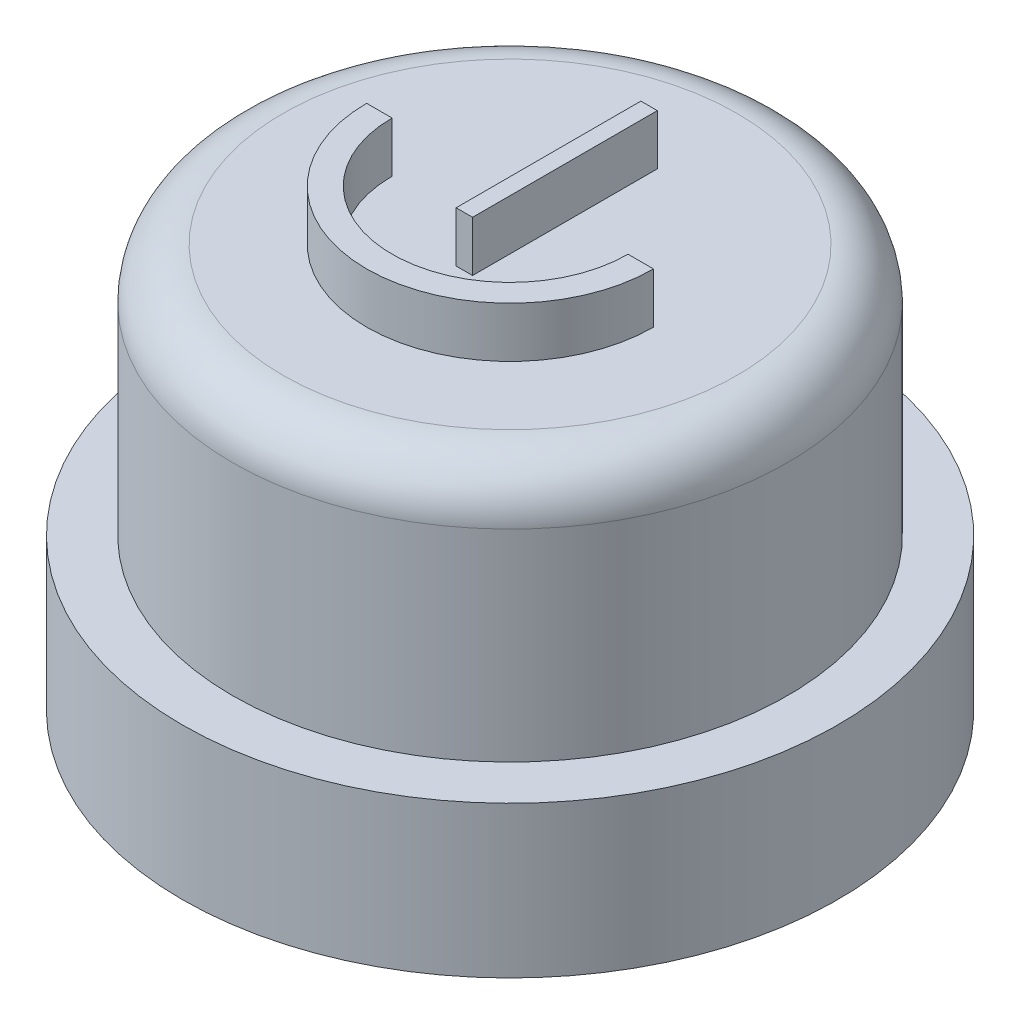
ISO-10303-21;
HEADER;
FILE_DESCRIPTION(('STEP AP214'),'2;1');
FILE_NAME('part.step','',(''),(''),'','','');
FILE_SCHEMA(('AUTOMOTIVE_DESIGN { 1 0 10303 214 1 1 1 1 }'));
ENDSEC;
DATA;
#1=APPLICATION_CONTEXT('core data for automotive mechanical design processes');
#2=APPLICATION_PROTOCOL_DEFINITION('international standard','automotive_design',2000,#1);
#3=PRODUCT_CONTEXT('',#1,'mechanical');
#4=PRODUCT('Part','Part','',(#3));
#5=PRODUCT_RELATED_PRODUCT_CATEGORY('part','',(#4));
#6=PRODUCT_DEFINITION_FORMATION('','',#4);
#7=PRODUCT_DEFINITION_CONTEXT('part definition',#1,'design');
#8=PRODUCT_DEFINITION('design','',#6,#7);
#9=PRODUCT_DEFINITION_SHAPE('','',#8);
#10=(LENGTH_UNIT() NAMED_UNIT(*) SI_UNIT(.MILLI.,.METRE.));
#11=(NAMED_UNIT(*) PLANE_ANGLE_UNIT() SI_UNIT($,.RADIAN.));
#12=(NAMED_UNIT(*) SI_UNIT($,.STERADIAN.) SOLID_ANGLE_UNIT());
#13=UNCERTAINTY_MEASURE_WITH_UNIT(LENGTH_MEASURE(1.E-05),#10,'distance_accuracy_value','');
#14=(GEOMETRIC_REPRESENTATION_CONTEXT(3) GLOBAL_UNCERTAINTY_ASSIGNED_CONTEXT((#13)) GLOBAL_UNIT_ASSIGNED_CONTEXT((#10,
#11,#12)) REPRESENTATION_CONTEXT('',''));
#15=CARTESIAN_POINT('',(0.,0.,0.));
#16=DIRECTION('',(0.,0.,1.));
#17=DIRECTION('',(1.,0.,0.));
#18=AXIS2_PLACEMENT_3D('',#15,#16,#17);
#19=CARTESIAN_POINT('',(0.,8.,0.));
#20=DIRECTION('',(0.,1.,0.));
#21=DIRECTION('',(0.,0.,1.));
#22=AXIS2_PLACEMENT_3D('',#19,#20,#21);
#23=PLANE('',#22);
#24=CARTESIAN_POINT('',(0.,8.,0.));
#25=DIRECTION('',(0.,1.,0.));
#26=DIRECTION('',(0.,0.,1.));
#27=AXIS2_PLACEMENT_3D('',#24,#25,#26);
#28=CIRCLE('',#27,4.5);
#29=CARTESIAN_POINT('',(0.,8.,4.5));
#30=VERTEX_POINT('',#29);
#31=EDGE_CURVE('E52',#30,#30,#28,.T.);
#32=ORIENTED_EDGE('',*,*,#31,.T.);
#33=EDGE_LOOP('',(#32));
#34=FACE_BOUND('',#33,.T.);
#35=DIRECTION('',(-1.,0.,0.));
#36=VECTOR('',#35,1.);
#37=CARTESIAN_POINT('',(2.33911709935371,8.,0.));
#38=LINE('',#37,#36);
#39=CARTESIAN_POINT('',(2.84359749629718,8.,0.));
#40=VERTEX_POINT('',#39);
#41=CARTESIAN_POINT('',(2.33911709935371,8.,0.));
#42=VERTEX_POINT('',#41);
#43=EDGE_CURVE('E139',#40,#42,#38,.T.);
#44=ORIENTED_EDGE('',*,*,#43,.F.);
#45=CARTESIAN_POINT('',(0.,8.,0.));
#46=DIRECTION('',(0.,1.,0.));
#47=DIRECTION('',(0.,0.,1.));
#48=AXIS2_PLACEMENT_3D('',#45,#46,#47);
#49=CIRCLE('',#48,2.84359749629718);
#50=CARTESIAN_POINT('',(-2.84359749629718,8.,0.));
#51=VERTEX_POINT('',#50);
#52=EDGE_CURVE('E134',#51,#40,#49,.T.);
#53=ORIENTED_EDGE('',*,*,#52,.F.);
#54=DIRECTION('',(-1.,0.,0.));
#55=VECTOR('',#54,1.);
#56=CARTESIAN_POINT('',(-2.84359749629718,8.,0.));
#57=LINE('',#56,#55);
#58=CARTESIAN_POINT('',(-2.33911709935371,8.,0.));
#59=VERTEX_POINT('',#58);
#60=EDGE_CURVE('E159',#59,#51,#57,.T.);
#61=ORIENTED_EDGE('',*,*,#60,.F.);
#62=CARTESIAN_POINT('',(0.,8.,0.));
#63=DIRECTION('',(0.,-1.,0.));
#64=DIRECTION('',(0.,0.,1.));
#65=AXIS2_PLACEMENT_3D('',#62,#63,#64);
#66=CIRCLE('',#65,2.33911709935371);
#67=EDGE_CURVE('E171',#42,#59,#66,.T.);
#68=ORIENTED_EDGE('',*,*,#67,.F.);
#69=EDGE_LOOP('',(#44,#53,#61,#68));
#70=FACE_BOUND('',#69,.T.);
#71=DIRECTION('',(-1.,0.,0.));
#72=VECTOR('',#71,1.);
#73=CARTESIAN_POINT('',(-0.163194216233981,8.,-2.75616898528501));
#74=LINE('',#73,#72);
#75=CARTESIAN_POINT('',(0.163194216233981,8.,-2.75616898528501));
#76=VERTEX_POINT('',#75);
#77=CARTESIAN_POINT('',(-0.163194216233981,8.,-2.75616898528501));
#78=VERTEX_POINT('',#77);
#79=EDGE_CURVE('E132',#76,#78,#74,.T.);
#80=ORIENTED_EDGE('',*,*,#79,.F.);
#81=DIRECTION('',(0.,0.,-1.));
#82=VECTOR('',#81,1.);
#83=CARTESIAN_POINT('',(0.163194216233981,8.,-2.75616898528501));
#84=LINE('',#83,#82);
#85=CARTESIAN_POINT('',(0.163194216233981,8.,0.906634534633198));
#86=VERTEX_POINT('',#85);
#87=EDGE_CURVE('E126',#86,#76,#84,.T.);
#88=ORIENTED_EDGE('',*,*,#87,.F.);
#89=DIRECTION('',(1.,0.,0.));
#90=VECTOR('',#89,1.);
#91=CARTESIAN_POINT('',(-0.163194216233981,8.,0.906634534633198));
#92=LINE('',#91,#90);
#93=CARTESIAN_POINT('',(-0.163194216233981,8.,0.906634534633198));
#94=VERTEX_POINT('',#93);
#95=EDGE_CURVE('E110',#94,#86,#92,.T.);
#96=ORIENTED_EDGE('',*,*,#95,.F.);
#97=DIRECTION('',(0.,0.,1.));
#98=VECTOR('',#97,1.);
#99=CARTESIAN_POINT('',(-0.163194216233981,8.,-2.75616898528501));
#100=LINE('',#99,#98);
#101=EDGE_CURVE('E119',#78,#94,#100,.T.);
#102=ORIENTED_EDGE('',*,*,#101,.F.);
#103=EDGE_LOOP('',(#80,#88,#96,#102));
#104=FACE_BOUND('',#103,.T.);
#105=ADVANCED_FACE('F43',(#34,#70,#104),#23,.T.);
#106=CARTESIAN_POINT('',(0.,3.,0.));
#107=DIRECTION('',(0.,-1.,0.));
#108=DIRECTION('',(0.,0.,-1.));
#109=AXIS2_PLACEMENT_3D('',#106,#107,#108);
#110=CYLINDRICAL_SURFACE('',#109,6.5);
#111=CARTESIAN_POINT('',(0.,3.,0.));
#112=DIRECTION('',(0.,1.,0.));
#113=DIRECTION('',(0.,0.,1.));
#114=AXIS2_PLACEMENT_3D('',#111,#112,#113);
#115=CIRCLE('',#114,6.5);
#116=CARTESIAN_POINT('',(0.,3.,6.5));
#117=VERTEX_POINT('',#116);
#118=EDGE_CURVE('E193',#117,#117,#115,.T.);
#119=ORIENTED_EDGE('',*,*,#118,.F.);
#120=EDGE_LOOP('',(#119));
#121=FACE_BOUND('',#120,.T.);
#122=CARTESIAN_POINT('',(0.,0.,0.));
#123=DIRECTION('',(0.,1.,0.));
#124=DIRECTION('',(0.,0.,1.));
#125=AXIS2_PLACEMENT_3D('',#122,#123,#124);
#126=CIRCLE('',#125,6.5);
#127=CARTESIAN_POINT('',(0.,0.,6.5));
#128=VERTEX_POINT('',#127);
#129=EDGE_CURVE('E188',#128,#128,#126,.T.);
#130=ORIENTED_EDGE('',*,*,#129,.T.);
#131=EDGE_LOOP('',(#130));
#132=FACE_BOUND('',#131,.T.);
#133=ADVANCED_FACE('F221',(#121,#132),#110,.T.);
#134=CARTESIAN_POINT('',(0.,3.,0.));
#135=DIRECTION('',(0.,1.,0.));
#136=DIRECTION('',(0.,0.,1.));
#137=AXIS2_PLACEMENT_3D('',#134,#135,#136);
#138=PLANE('',#137);
#139=CARTESIAN_POINT('',(0.,3.,0.));
#140=DIRECTION('',(0.,1.,0.));
#141=DIRECTION('',(0.,0.,1.));
#142=AXIS2_PLACEMENT_3D('',#139,#140,#141);
#143=CIRCLE('',#142,5.5);
#144=CARTESIAN_POINT('',(0.,3.,5.5));
#145=VERTEX_POINT('',#144);
#146=EDGE_CURVE('E189',#145,#145,#143,.T.);
#147=ORIENTED_EDGE('',*,*,#146,.F.);
#148=EDGE_LOOP('',(#147));
#149=FACE_BOUND('',#148,.T.);
#150=ORIENTED_EDGE('',*,*,#118,.T.);
#151=EDGE_LOOP('',(#150));
#152=FACE_BOUND('',#151,.T.);
#153=ADVANCED_FACE('F226',(#149,#152),#138,.T.);
#154=CARTESIAN_POINT('',(0.,0.,0.));
#155=DIRECTION('',(0.,1.,0.));
#156=DIRECTION('',(0.,0.,1.));
#157=AXIS2_PLACEMENT_3D('',#154,#155,#156);
#158=PLANE('',#157);
#159=ORIENTED_EDGE('',*,*,#129,.F.);
#160=EDGE_LOOP('',(#159));
#161=FACE_BOUND('',#160,.T.);
#162=ADVANCED_FACE('F216',(#161),#158,.F.);
#163=CARTESIAN_POINT('',(0.,8.,0.));
#164=DIRECTION('',(0.,-1.,0.));
#165=DIRECTION('',(0.,0.,-1.));
#166=AXIS2_PLACEMENT_3D('',#163,#164,#165);
#167=CYLINDRICAL_SURFACE('',#166,5.5);
#168=CARTESIAN_POINT('',(0.,7.,0.));
#169=DIRECTION('',(0.,1.,0.));
#170=DIRECTION('',(0.,0.,1.));
#171=AXIS2_PLACEMENT_3D('',#168,#169,#170);
#172=CIRCLE('',#171,5.5);
#173=CARTESIAN_POINT('',(0.,7.,5.5));
#174=VERTEX_POINT('',#173);
#175=EDGE_CURVE('E11',#174,#174,#172,.F.);
#176=ORIENTED_EDGE('',*,*,#175,.T.);
#177=EDGE_LOOP('',(#176));
#178=FACE_BOUND('',#177,.T.);
#179=ORIENTED_EDGE('',*,*,#146,.T.);
#180=EDGE_LOOP('',(#179));
#181=FACE_BOUND('',#180,.T.);
#182=ADVANCED_FACE('F207',(#178,#181),#167,.T.);
#183=CARTESIAN_POINT('',(0.,7.,0.));
#184=DIRECTION('',(0.,1.,0.));
#185=DIRECTION('',(0.,0.,1.));
#186=AXIS2_PLACEMENT_3D('',#183,#184,#185);
#187=TOROIDAL_SURFACE('',#186,4.5,1.);
#188=ORIENTED_EDGE('',*,*,#175,.F.);
#189=EDGE_LOOP('',(#188));
#190=FACE_BOUND('',#189,.T.);
#191=ORIENTED_EDGE('',*,*,#31,.F.);
#192=EDGE_LOOP('',(#191));
#193=FACE_BOUND('',#192,.T.);
#194=ADVANCED_FACE('F45',(#190,#193),#187,.T.);
#195=CARTESIAN_POINT('',(0.,9.,0.));
#196=DIRECTION('',(0.,-1.,0.));
#197=DIRECTION('',(0.,0.,-1.));
#198=AXIS2_PLACEMENT_3D('',#195,#196,#197);
#199=CYLINDRICAL_SURFACE('',#198,2.84359749629718);
#200=ORIENTED_EDGE('',*,*,#52,.T.);
#201=DIRECTION('',(0.,-1.,0.));
#202=VECTOR('',#201,1.);
#203=CARTESIAN_POINT('',(2.84359749629718,9.,0.));
#204=LINE('',#203,#202);
#205=CARTESIAN_POINT('',(2.84359749629718,9.,0.));
#206=VERTEX_POINT('',#205);
#207=EDGE_CURVE('E185',#206,#40,#204,.T.);
#208=ORIENTED_EDGE('',*,*,#207,.F.);
#209=CARTESIAN_POINT('',(0.,9.,0.));
#210=DIRECTION('',(0.,1.,0.));
#211=DIRECTION('',(0.,0.,1.));
#212=AXIS2_PLACEMENT_3D('',#209,#210,#211);
#213=CIRCLE('',#212,2.84359749629718);
#214=CARTESIAN_POINT('',(-2.84359749629718,9.,0.));
#215=VERTEX_POINT('',#214);
#216=EDGE_CURVE('E154',#215,#206,#213,.T.);
#217=ORIENTED_EDGE('',*,*,#216,.F.);
#218=DIRECTION('',(0.,-1.,0.));
#219=VECTOR('',#218,1.);
#220=CARTESIAN_POINT('',(-2.84359749629718,9.,0.));
#221=LINE('',#220,#219);
#222=EDGE_CURVE('E167',#215,#51,#221,.T.);
#223=ORIENTED_EDGE('',*,*,#222,.T.);
#224=EDGE_LOOP('',(#200,#208,#217,#223));
#225=FACE_BOUND('',#224,.T.);
#226=ADVANCED_FACE('F206',(#225),#199,.T.);
#227=CARTESIAN_POINT('',(2.33911709935371,9.,0.));
#228=DIRECTION('',(0.,0.,1.));
#229=DIRECTION('',(1.,0.,0.));
#230=AXIS2_PLACEMENT_3D('',#227,#228,#229);
#231=PLANE('',#230);
#232=ORIENTED_EDGE('',*,*,#43,.T.);
#233=DIRECTION('',(0.,-1.,0.));
#234=VECTOR('',#233,1.);
#235=CARTESIAN_POINT('',(2.33911709935371,9.,0.));
#236=LINE('',#235,#234);
#237=CARTESIAN_POINT('',(2.33911709935371,9.,0.));
#238=VERTEX_POINT('',#237);
#239=EDGE_CURVE('E181',#238,#42,#236,.T.);
#240=ORIENTED_EDGE('',*,*,#239,.F.);
#241=DIRECTION('',(-1.,0.,0.));
#242=VECTOR('',#241,1.);
#243=CARTESIAN_POINT('',(2.33911709935371,9.,0.));
#244=LINE('',#243,#242);
#245=EDGE_CURVE('E158',#206,#238,#244,.T.);
#246=ORIENTED_EDGE('',*,*,#245,.F.);
#247=ORIENTED_EDGE('',*,*,#207,.T.);
#248=EDGE_LOOP('',(#232,#240,#246,#247));
#249=FACE_BOUND('',#248,.T.);
#250=ADVANCED_FACE('F213',(#249),#231,.F.);
#251=CARTESIAN_POINT('',(0.,9.,0.));
#252=DIRECTION('',(0.,-1.,0.));
#253=DIRECTION('',(0.,0.,-1.));
#254=AXIS2_PLACEMENT_3D('',#251,#252,#253);
#255=CYLINDRICAL_SURFACE('',#254,2.33911709935371);
#256=ORIENTED_EDGE('',*,*,#67,.T.);
#257=DIRECTION('',(0.,-1.,0.));
#258=VECTOR('',#257,1.);
#259=CARTESIAN_POINT('',(-2.33911709935371,9.,0.));
#260=LINE('',#259,#258);
#261=CARTESIAN_POINT('',(-2.33911709935371,9.,0.));
#262=VERTEX_POINT('',#261);
#263=EDGE_CURVE('E67',#262,#59,#260,.T.);
#264=ORIENTED_EDGE('',*,*,#263,.F.);
#265=CARTESIAN_POINT('',(0.,9.,0.));
#266=DIRECTION('',(0.,-1.,0.));
#267=DIRECTION('',(0.,0.,1.));
#268=AXIS2_PLACEMENT_3D('',#265,#266,#267);
#269=CIRCLE('',#268,2.33911709935371);
#270=EDGE_CURVE('E162',#238,#262,#269,.T.);
#271=ORIENTED_EDGE('',*,*,#270,.F.);
#272=ORIENTED_EDGE('',*,*,#239,.T.);
#273=EDGE_LOOP('',(#256,#264,#271,#272));
#274=FACE_BOUND('',#273,.T.);
#275=ADVANCED_FACE('F275',(#274),#255,.F.);
#276=CARTESIAN_POINT('',(-2.84359749629718,9.,0.));
#277=DIRECTION('',(0.,0.,1.));
#278=DIRECTION('',(1.,0.,0.));
#279=AXIS2_PLACEMENT_3D('',#276,#277,#278);
#280=PLANE('',#279);
#281=ORIENTED_EDGE('',*,*,#60,.T.);
#282=ORIENTED_EDGE('',*,*,#222,.F.);
#283=DIRECTION('',(-1.,0.,0.));
#284=VECTOR('',#283,1.);
#285=CARTESIAN_POINT('',(-2.84359749629718,9.,0.));
#286=LINE('',#285,#284);
#287=EDGE_CURVE('E165',#262,#215,#286,.T.);
#288=ORIENTED_EDGE('',*,*,#287,.F.);
#289=ORIENTED_EDGE('',*,*,#263,.T.);
#290=EDGE_LOOP('',(#281,#282,#288,#289));
#291=FACE_BOUND('',#290,.T.);
#292=ADVANCED_FACE('F285',(#291),#280,.F.);
#293=CARTESIAN_POINT('',(0.,9.,0.));
#294=DIRECTION('',(0.,1.,0.));
#295=DIRECTION('',(0.,0.,1.));
#296=AXIS2_PLACEMENT_3D('',#293,#294,#295);
#297=PLANE('',#296);
#298=ORIENTED_EDGE('',*,*,#216,.T.);
#299=ORIENTED_EDGE('',*,*,#245,.T.);
#300=ORIENTED_EDGE('',*,*,#270,.T.);
#301=ORIENTED_EDGE('',*,*,#287,.T.);
#302=EDGE_LOOP('',(#298,#299,#300,#301));
#303=FACE_BOUND('',#302,.T.);
#304=ADVANCED_FACE('F296',(#303),#297,.T.);
#305=CARTESIAN_POINT('',(0.163194216233981,9.,-2.75616898528501));
#306=DIRECTION('',(-1.,0.,0.));
#307=DIRECTION('',(0.,0.,1.));
#308=AXIS2_PLACEMENT_3D('',#305,#306,#307);
#309=PLANE('',#308);
#310=ORIENTED_EDGE('',*,*,#87,.T.);
#311=DIRECTION('',(0.,-1.,0.));
#312=VECTOR('',#311,1.);
#313=CARTESIAN_POINT('',(0.163194216233981,9.,-2.75616898528501));
#314=LINE('',#313,#312);
#315=CARTESIAN_POINT('',(0.163194216233981,9.,-2.75616898528501));
#316=VERTEX_POINT('',#315);
#317=EDGE_CURVE('E391',#316,#76,#314,.T.);
#318=ORIENTED_EDGE('',*,*,#317,.F.);
#319=DIRECTION('',(0.,0.,-1.));
#320=VECTOR('',#319,1.);
#321=CARTESIAN_POINT('',(0.163194216233981,9.,-2.75616898528501));
#322=LINE('',#321,#320);
#323=CARTESIAN_POINT('',(0.163194216233981,9.,0.906634534633198));
#324=VERTEX_POINT('',#323);
#325=EDGE_CURVE('E120',#324,#316,#322,.T.);
#326=ORIENTED_EDGE('',*,*,#325,.F.);
#327=DIRECTION('',(0.,-1.,0.));
#328=VECTOR('',#327,1.);
#329=CARTESIAN_POINT('',(0.163194216233981,9.,0.906634534633198));
#330=LINE('',#329,#328);
#331=EDGE_CURVE('E113',#324,#86,#330,.T.);
#332=ORIENTED_EDGE('',*,*,#331,.T.);
#333=EDGE_LOOP('',(#310,#318,#326,#332));
#334=FACE_BOUND('',#333,.T.);
#335=ADVANCED_FACE('F124',(#334),#309,.F.);
#336=CARTESIAN_POINT('',(-0.163194216233981,9.,-2.75616898528501));
#337=DIRECTION('',(0.,0.,1.));
#338=DIRECTION('',(1.,0.,0.));
#339=AXIS2_PLACEMENT_3D('',#336,#337,#338);
#340=PLANE('',#339);
#341=ORIENTED_EDGE('',*,*,#79,.T.);
#342=DIRECTION('',(0.,-1.,0.));
#343=VECTOR('',#342,1.);
#344=CARTESIAN_POINT('',(-0.163194216233981,9.,-2.75616898528501));
#345=LINE('',#344,#343);
#346=CARTESIAN_POINT('',(-0.163194216233981,9.,-2.75616898528501));
#347=VERTEX_POINT('',#346);
#348=EDGE_CURVE('E393',#347,#78,#345,.T.);
#349=ORIENTED_EDGE('',*,*,#348,.F.);
#350=DIRECTION('',(-1.,0.,0.));
#351=VECTOR('',#350,1.);
#352=CARTESIAN_POINT('',(-0.163194216233981,9.,-2.75616898528501));
#353=LINE('',#352,#351);
#354=EDGE_CURVE('E149',#316,#347,#353,.T.);
#355=ORIENTED_EDGE('',*,*,#354,.F.);
#356=ORIENTED_EDGE('',*,*,#317,.T.);
#357=EDGE_LOOP('',(#341,#349,#355,#356));
#358=FACE_BOUND('',#357,.T.);
#359=ADVANCED_FACE('F316',(#358),#340,.F.);
#360=CARTESIAN_POINT('',(-0.163194216233981,9.,-2.75616898528501));
#361=DIRECTION('',(1.,0.,0.));
#362=DIRECTION('',(0.,0.,-1.));
#363=AXIS2_PLACEMENT_3D('',#360,#361,#362);
#364=PLANE('',#363);
#365=ORIENTED_EDGE('',*,*,#101,.T.);
#366=DIRECTION('',(0.,-1.,0.));
#367=VECTOR('',#366,1.);
#368=CARTESIAN_POINT('',(-0.163194216233981,9.,0.906634534633198));
#369=LINE('',#368,#367);
#370=CARTESIAN_POINT('',(-0.163194216233981,9.,0.906634534633198));
#371=VERTEX_POINT('',#370);
#372=EDGE_CURVE('E59',#371,#94,#369,.T.);
#373=ORIENTED_EDGE('',*,*,#372,.F.);
#374=DIRECTION('',(0.,0.,1.));
#375=VECTOR('',#374,1.);
#376=CARTESIAN_POINT('',(-0.163194216233981,9.,-2.75616898528501));
#377=LINE('',#376,#375);
#378=EDGE_CURVE('E146',#347,#371,#377,.T.);
#379=ORIENTED_EDGE('',*,*,#378,.F.);
#380=ORIENTED_EDGE('',*,*,#348,.T.);
#381=EDGE_LOOP('',(#365,#373,#379,#380));
#382=FACE_BOUND('',#381,.T.);
#383=ADVANCED_FACE('F326',(#382),#364,.F.);
#384=CARTESIAN_POINT('',(-0.163194216233981,9.,0.906634534633198));
#385=DIRECTION('',(0.,0.,-1.));
#386=DIRECTION('',(-1.,0.,0.));
#387=AXIS2_PLACEMENT_3D('',#384,#385,#386);
#388=PLANE('',#387);
#389=ORIENTED_EDGE('',*,*,#95,.T.);
#390=ORIENTED_EDGE('',*,*,#331,.F.);
#391=DIRECTION('',(1.,0.,0.));
#392=VECTOR('',#391,1.);
#393=CARTESIAN_POINT('',(-0.163194216233981,9.,0.906634534633198));
#394=LINE('',#393,#392);
#395=EDGE_CURVE('E130',#371,#324,#394,.T.);
#396=ORIENTED_EDGE('',*,*,#395,.F.);
#397=ORIENTED_EDGE('',*,*,#372,.T.);
#398=EDGE_LOOP('',(#389,#390,#396,#397));
#399=FACE_BOUND('',#398,.T.);
#400=ADVANCED_FACE('F112',(#399),#388,.F.);
#401=CARTESIAN_POINT('',(0.,9.,0.));
#402=DIRECTION('',(0.,1.,0.));
#403=DIRECTION('',(0.,0.,1.));
#404=AXIS2_PLACEMENT_3D('',#401,#402,#403);
#405=PLANE('',#404);
#406=ORIENTED_EDGE('',*,*,#325,.T.);
#407=ORIENTED_EDGE('',*,*,#354,.T.);
#408=ORIENTED_EDGE('',*,*,#378,.T.);
#409=ORIENTED_EDGE('',*,*,#395,.T.);
#410=EDGE_LOOP('',(#406,#407,#408,#409));
#411=FACE_BOUND('',#410,.T.);
#412=ADVANCED_FACE('F347',(#411),#405,.T.);
#413=CLOSED_SHELL('',(#105,#133,#153,#162,#182,#194,#226,#250,#275,#292,#304,#335,#359,#383,
#400,#412));
#414=MANIFOLD_SOLID_BREP('B2',#413);
#415=ADVANCED_BREP_SHAPE_REPRESENTATION('',(#18,#414),#14);
#416=SHAPE_DEFINITION_REPRESENTATION(#9,#415);
ENDSEC;
END-ISO-10303-21;
